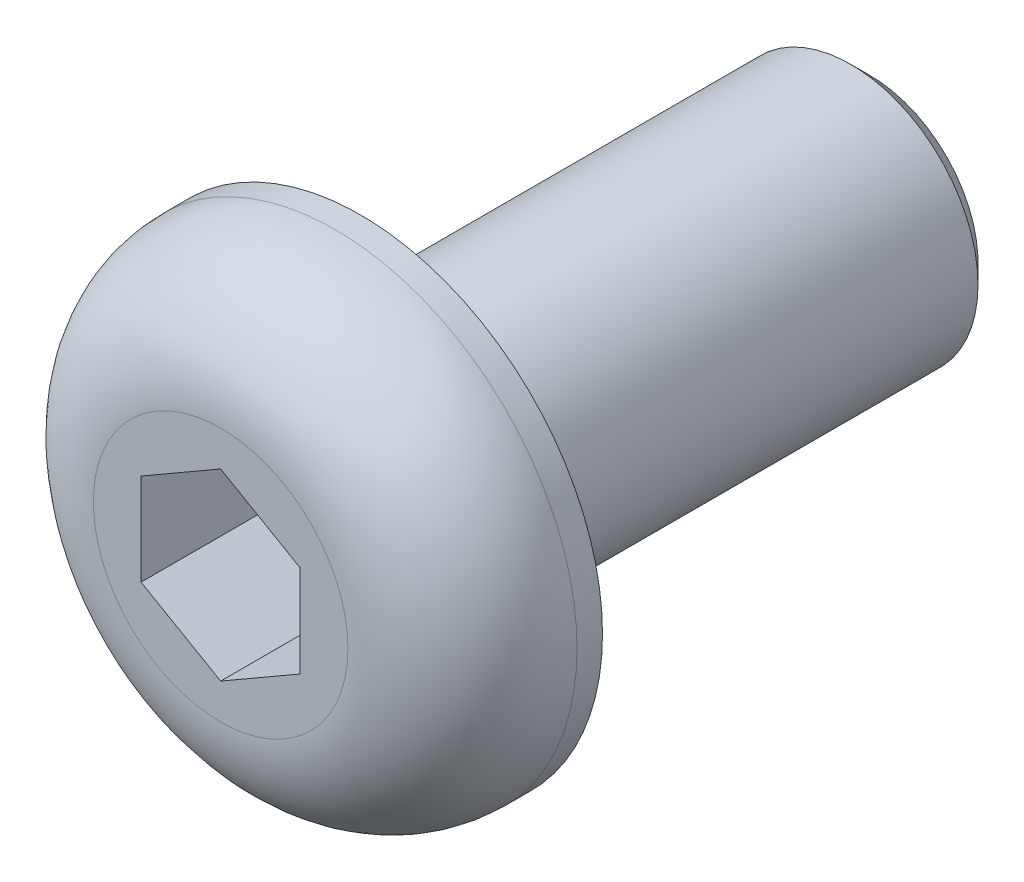
ISO-10303-21;
HEADER;
FILE_DESCRIPTION(('STEP AP214'),'2;1');
FILE_NAME('part.step','',(''),(''),'','','');
FILE_SCHEMA(('AUTOMOTIVE_DESIGN { 1 0 10303 214 1 1 1 1 }'));
ENDSEC;
DATA;
#1=APPLICATION_CONTEXT('core data for automotive mechanical design processes');
#2=APPLICATION_PROTOCOL_DEFINITION('international standard','automotive_design',2000,#1);
#3=PRODUCT_CONTEXT('',#1,'mechanical');
#4=PRODUCT('Part','Part','',(#3));
#5=PRODUCT_RELATED_PRODUCT_CATEGORY('part','',(#4));
#6=PRODUCT_DEFINITION_FORMATION('','',#4);
#7=PRODUCT_DEFINITION_CONTEXT('part definition',#1,'design');
#8=PRODUCT_DEFINITION('design','',#6,#7);
#9=PRODUCT_DEFINITION_SHAPE('','',#8);
#10=(LENGTH_UNIT() NAMED_UNIT(*) SI_UNIT(.MILLI.,.METRE.));
#11=(NAMED_UNIT(*) PLANE_ANGLE_UNIT() SI_UNIT($,.RADIAN.));
#12=(NAMED_UNIT(*) SI_UNIT($,.STERADIAN.) SOLID_ANGLE_UNIT());
#13=UNCERTAINTY_MEASURE_WITH_UNIT(LENGTH_MEASURE(1.E-05),#10,'distance_accuracy_value','');
#14=(GEOMETRIC_REPRESENTATION_CONTEXT(3) GLOBAL_UNCERTAINTY_ASSIGNED_CONTEXT((#13)) GLOBAL_UNIT_ASSIGNED_CONTEXT((#10,
#11,#12)) REPRESENTATION_CONTEXT('',''));
#15=CARTESIAN_POINT('',(0.,0.,0.));
#16=DIRECTION('',(0.,0.,1.));
#17=DIRECTION('',(1.,0.,0.));
#18=AXIS2_PLACEMENT_3D('',#15,#16,#17);
#19=CARTESIAN_POINT('',(0.,0.,0.));
#20=DIRECTION('',(0.,0.,1.));
#21=DIRECTION('',(1.,0.,0.));
#22=AXIS2_PLACEMENT_3D('',#19,#20,#21);
#23=PLANE('',#22);
#24=CARTESIAN_POINT('',(0.,0.,0.));
#25=DIRECTION('',(0.,0.,1.));
#26=DIRECTION('',(1.,0.,0.));
#27=AXIS2_PLACEMENT_3D('',#24,#25,#26);
#28=CIRCLE('',#27,3.8);
#29=CARTESIAN_POINT('',(3.8,0.,0.));
#30=VERTEX_POINT('',#29);
#31=EDGE_CURVE('E135',#30,#30,#28,.T.);
#32=ORIENTED_EDGE('',*,*,#31,.F.);
#33=EDGE_LOOP('',(#32));
#34=FACE_BOUND('',#33,.T.);
#35=CARTESIAN_POINT('',(0.,0.,0.));
#36=DIRECTION('',(0.,0.,1.));
#37=DIRECTION('',(1.,0.,0.));
#38=AXIS2_PLACEMENT_3D('',#35,#36,#37);
#39=CIRCLE('',#38,2.);
#40=CARTESIAN_POINT('',(2.,0.,0.));
#41=VERTEX_POINT('',#40);
#42=EDGE_CURVE('E143',#41,#41,#39,.F.);
#43=ORIENTED_EDGE('',*,*,#42,.F.);
#44=EDGE_LOOP('',(#43));
#45=FACE_BOUND('',#44,.T.);
#46=ADVANCED_FACE('F33',(#34,#45),#23,.F.);
#47=CARTESIAN_POINT('',(0.,0.,2.2));
#48=DIRECTION('',(0.,0.,-1.));
#49=DIRECTION('',(-1.,0.,0.));
#50=AXIS2_PLACEMENT_3D('',#47,#48,#49);
#51=CYLINDRICAL_SURFACE('',#50,3.8);
#52=CARTESIAN_POINT('',(0.,0.,0.4));
#53=DIRECTION('',(0.,0.,1.));
#54=DIRECTION('',(1.,0.,0.));
#55=AXIS2_PLACEMENT_3D('',#52,#53,#54);
#56=CIRCLE('',#55,3.8);
#57=CARTESIAN_POINT('',(3.8,0.,0.4));
#58=VERTEX_POINT('',#57);
#59=EDGE_CURVE('E11',#58,#58,#56,.F.);
#60=ORIENTED_EDGE('',*,*,#59,.T.);
#61=EDGE_LOOP('',(#60));
#62=FACE_BOUND('',#61,.T.);
#63=ORIENTED_EDGE('',*,*,#31,.T.);
#64=EDGE_LOOP('',(#63));
#65=FACE_BOUND('',#64,.T.);
#66=ADVANCED_FACE('F166',(#62,#65),#51,.T.);
#67=CARTESIAN_POINT('',(0.,0.,2.2));
#68=DIRECTION('',(0.,0.,1.));
#69=DIRECTION('',(1.,0.,0.));
#70=AXIS2_PLACEMENT_3D('',#67,#68,#69);
#71=PLANE('',#70);
#72=CARTESIAN_POINT('',(0.,0.,2.2));
#73=DIRECTION('',(0.,0.,1.));
#74=DIRECTION('',(1.,0.,0.));
#75=AXIS2_PLACEMENT_3D('',#72,#73,#74);
#76=CIRCLE('',#75,2.);
#77=CARTESIAN_POINT('',(2.,0.,2.2));
#78=VERTEX_POINT('',#77);
#79=EDGE_CURVE('E41',#78,#78,#76,.T.);
#80=ORIENTED_EDGE('',*,*,#79,.T.);
#81=EDGE_LOOP('',(#80));
#82=FACE_BOUND('',#81,.T.);
#83=DIRECTION('',(-0.866025403784439,0.5,0.));
#84=VECTOR('',#83,1.);
#85=CARTESIAN_POINT('',(1.25,0.721687836487033,2.2));
#86=LINE('',#85,#84);
#87=CARTESIAN_POINT('',(1.25,0.721687836487033,2.2));
#88=VERTEX_POINT('',#87);
#89=CARTESIAN_POINT('',(0.,1.44337567297406,2.2));
#90=VERTEX_POINT('',#89);
#91=EDGE_CURVE('E48',#88,#90,#86,.T.);
#92=ORIENTED_EDGE('',*,*,#91,.F.);
#93=DIRECTION('',(0.,1.,0.));
#94=VECTOR('',#93,1.);
#95=CARTESIAN_POINT('',(1.25,-0.721687836487033,2.2));
#96=LINE('',#95,#94);
#97=CARTESIAN_POINT('',(1.25,-0.721687836487033,2.2));
#98=VERTEX_POINT('',#97);
#99=EDGE_CURVE('E131',#98,#88,#96,.T.);
#100=ORIENTED_EDGE('',*,*,#99,.F.);
#101=DIRECTION('',(0.866025403784439,0.5,0.));
#102=VECTOR('',#101,1.);
#103=CARTESIAN_POINT('',(0.,-1.44337567297406,2.2));
#104=LINE('',#103,#102);
#105=CARTESIAN_POINT('',(0.,-1.44337567297406,2.2));
#106=VERTEX_POINT('',#105);
#107=EDGE_CURVE('E129',#106,#98,#104,.T.);
#108=ORIENTED_EDGE('',*,*,#107,.F.);
#109=DIRECTION('',(0.866025403784439,-0.5,0.));
#110=VECTOR('',#109,1.);
#111=CARTESIAN_POINT('',(-1.25,-0.721687836487032,2.2));
#112=LINE('',#111,#110);
#113=CARTESIAN_POINT('',(-1.25,-0.721687836487032,2.2));
#114=VERTEX_POINT('',#113);
#115=EDGE_CURVE('E96',#114,#106,#112,.T.);
#116=ORIENTED_EDGE('',*,*,#115,.F.);
#117=DIRECTION('',(0.,-1.,0.));
#118=VECTOR('',#117,1.);
#119=CARTESIAN_POINT('',(-1.25,0.721687836487033,2.2));
#120=LINE('',#119,#118);
#121=CARTESIAN_POINT('',(-1.25,0.721687836487033,2.2));
#122=VERTEX_POINT('',#121);
#123=EDGE_CURVE('E125',#122,#114,#120,.T.);
#124=ORIENTED_EDGE('',*,*,#123,.F.);
#125=DIRECTION('',(-0.866025403784439,-0.5,0.));
#126=VECTOR('',#125,1.);
#127=CARTESIAN_POINT('',(0.,1.44337567297406,2.2));
#128=LINE('',#127,#126);
#129=EDGE_CURVE('E122',#90,#122,#128,.T.);
#130=ORIENTED_EDGE('',*,*,#129,.F.);
#131=EDGE_LOOP('',(#92,#100,#108,#116,#124,#130));
#132=FACE_BOUND('',#131,.T.);
#133=ADVANCED_FACE('F154',(#82,#132),#71,.T.);
#134=CARTESIAN_POINT('',(0.,0.,-8.));
#135=DIRECTION('',(0.,0.,1.));
#136=DIRECTION('',(1.,0.,0.));
#137=AXIS2_PLACEMENT_3D('',#134,#135,#136);
#138=CYLINDRICAL_SURFACE('',#137,2.);
#139=CARTESIAN_POINT('',(0.,0.,-7.7));
#140=DIRECTION('',(0.,0.,-1.));
#141=DIRECTION('',(-1.,0.,0.));
#142=AXIS2_PLACEMENT_3D('',#139,#140,#141);
#143=CIRCLE('',#142,2.);
#144=CARTESIAN_POINT('',(-2.,0.,-7.7));
#145=VERTEX_POINT('',#144);
#146=EDGE_CURVE('E149',#145,#145,#143,.F.);
#147=ORIENTED_EDGE('',*,*,#146,.T.);
#148=EDGE_LOOP('',(#147));
#149=FACE_BOUND('',#148,.T.);
#150=ORIENTED_EDGE('',*,*,#42,.T.);
#151=EDGE_LOOP('',(#150));
#152=FACE_BOUND('',#151,.T.);
#153=ADVANCED_FACE('F189',(#149,#152),#138,.T.);
#154=CARTESIAN_POINT('',(0.,0.,-8.));
#155=DIRECTION('',(0.,0.,-1.));
#156=DIRECTION('',(-1.,0.,0.));
#157=AXIS2_PLACEMENT_3D('',#154,#155,#156);
#158=PLANE('',#157);
#159=CARTESIAN_POINT('',(0.,0.,-8.));
#160=DIRECTION('',(0.,0.,-1.));
#161=DIRECTION('',(-1.,0.,0.));
#162=AXIS2_PLACEMENT_3D('',#159,#160,#161);
#163=CIRCLE('',#162,1.7);
#164=CARTESIAN_POINT('',(-1.7,0.,-8.));
#165=VERTEX_POINT('',#164);
#166=EDGE_CURVE('E146',#165,#165,#163,.T.);
#167=ORIENTED_EDGE('',*,*,#166,.T.);
#168=EDGE_LOOP('',(#167));
#169=FACE_BOUND('',#168,.T.);
#170=ADVANCED_FACE('F181',(#169),#158,.T.);
#171=CARTESIAN_POINT('',(0.,0.,-8.));
#172=DIRECTION('',(0.,0.,1.));
#173=DIRECTION('',(1.,0.,0.));
#174=AXIS2_PLACEMENT_3D('',#171,#172,#173);
#175=CONICAL_SURFACE('',#174,1.7,0.785398163397447);
#176=ORIENTED_EDGE('',*,*,#146,.F.);
#177=EDGE_LOOP('',(#176));
#178=FACE_BOUND('',#177,.T.);
#179=ORIENTED_EDGE('',*,*,#166,.F.);
#180=EDGE_LOOP('',(#179));
#181=FACE_BOUND('',#180,.T.);
#182=ADVANCED_FACE('F178',(#178,#181),#175,.T.);
#183=CARTESIAN_POINT('',(1.25,0.721687836487033,0.2));
#184=DIRECTION('',(0.5,0.866025403784439,0.));
#185=DIRECTION('',(-0.866025403784439,0.5,0.));
#186=AXIS2_PLACEMENT_3D('',#183,#184,#185);
#187=PLANE('',#186);
#188=ORIENTED_EDGE('',*,*,#91,.T.);
#189=DIRECTION('',(0.,0.,1.));
#190=VECTOR('',#189,1.);
#191=CARTESIAN_POINT('',(0.,1.44337567297406,0.2));
#192=LINE('',#191,#190);
#193=CARTESIAN_POINT('',(0.,1.44337567297406,0.2));
#194=VERTEX_POINT('',#193);
#195=EDGE_CURVE('E78',#194,#90,#192,.T.);
#196=ORIENTED_EDGE('',*,*,#195,.F.);
#197=DIRECTION('',(-0.866025403784439,0.5,0.));
#198=VECTOR('',#197,1.);
#199=CARTESIAN_POINT('',(1.25,0.721687836487033,0.2));
#200=LINE('',#199,#198);
#201=CARTESIAN_POINT('',(1.25,0.721687836487033,0.2));
#202=VERTEX_POINT('',#201);
#203=EDGE_CURVE('E133',#202,#194,#200,.T.);
#204=ORIENTED_EDGE('',*,*,#203,.F.);
#205=DIRECTION('',(0.,0.,1.));
#206=VECTOR('',#205,1.);
#207=CARTESIAN_POINT('',(1.25,0.721687836487033,0.2));
#208=LINE('',#207,#206);
#209=EDGE_CURVE('E56',#202,#88,#208,.T.);
#210=ORIENTED_EDGE('',*,*,#209,.T.);
#211=EDGE_LOOP('',(#188,#196,#204,#210));
#212=FACE_BOUND('',#211,.T.);
#213=ADVANCED_FACE('F180',(#212),#187,.F.);
#214=CARTESIAN_POINT('',(1.25,-0.721687836487033,0.2));
#215=DIRECTION('',(1.,0.,0.));
#216=DIRECTION('',(0.,1.,0.));
#217=AXIS2_PLACEMENT_3D('',#214,#215,#216);
#218=PLANE('',#217);
#219=ORIENTED_EDGE('',*,*,#99,.T.);
#220=ORIENTED_EDGE('',*,*,#209,.F.);
#221=DIRECTION('',(0.,1.,0.));
#222=VECTOR('',#221,1.);
#223=CARTESIAN_POINT('',(1.25,-0.721687836487033,0.2));
#224=LINE('',#223,#222);
#225=CARTESIAN_POINT('',(1.25,-0.721687836487033,0.2));
#226=VERTEX_POINT('',#225);
#227=EDGE_CURVE('E108',#226,#202,#224,.T.);
#228=ORIENTED_EDGE('',*,*,#227,.F.);
#229=DIRECTION('',(0.,0.,1.));
#230=VECTOR('',#229,1.);
#231=CARTESIAN_POINT('',(1.25,-0.721687836487033,0.2));
#232=LINE('',#231,#230);
#233=EDGE_CURVE('E100',#226,#98,#232,.T.);
#234=ORIENTED_EDGE('',*,*,#233,.T.);
#235=EDGE_LOOP('',(#219,#220,#228,#234));
#236=FACE_BOUND('',#235,.T.);
#237=ADVANCED_FACE('F187',(#236),#218,.F.);
#238=CARTESIAN_POINT('',(0.,-1.44337567297406,0.2));
#239=DIRECTION('',(0.5,-0.866025403784439,0.));
#240=DIRECTION('',(0.866025403784439,0.5,0.));
#241=AXIS2_PLACEMENT_3D('',#238,#239,#240);
#242=PLANE('',#241);
#243=ORIENTED_EDGE('',*,*,#107,.T.);
#244=ORIENTED_EDGE('',*,*,#233,.F.);
#245=DIRECTION('',(0.866025403784439,0.5,0.));
#246=VECTOR('',#245,1.);
#247=CARTESIAN_POINT('',(0.,-1.44337567297406,0.2));
#248=LINE('',#247,#246);
#249=CARTESIAN_POINT('',(0.,-1.44337567297406,0.2));
#250=VERTEX_POINT('',#249);
#251=EDGE_CURVE('E104',#250,#226,#248,.T.);
#252=ORIENTED_EDGE('',*,*,#251,.F.);
#253=DIRECTION('',(0.,0.,1.));
#254=VECTOR('',#253,1.);
#255=CARTESIAN_POINT('',(0.,-1.44337567297406,0.2));
#256=LINE('',#255,#254);
#257=EDGE_CURVE('E89',#250,#106,#256,.T.);
#258=ORIENTED_EDGE('',*,*,#257,.T.);
#259=EDGE_LOOP('',(#243,#244,#252,#258));
#260=FACE_BOUND('',#259,.T.);
#261=ADVANCED_FACE('F105',(#260),#242,.F.);
#262=CARTESIAN_POINT('',(-1.25,-0.721687836487032,0.2));
#263=DIRECTION('',(-0.5,-0.866025403784439,0.));
#264=DIRECTION('',(0.866025403784439,-0.5,0.));
#265=AXIS2_PLACEMENT_3D('',#262,#263,#264);
#266=PLANE('',#265);
#267=ORIENTED_EDGE('',*,*,#115,.T.);
#268=ORIENTED_EDGE('',*,*,#257,.F.);
#269=DIRECTION('',(0.866025403784439,-0.5,0.));
#270=VECTOR('',#269,1.);
#271=CARTESIAN_POINT('',(-1.25,-0.721687836487032,0.2));
#272=LINE('',#271,#270);
#273=CARTESIAN_POINT('',(-1.25,-0.721687836487032,0.2));
#274=VERTEX_POINT('',#273);
#275=EDGE_CURVE('E93',#274,#250,#272,.T.);
#276=ORIENTED_EDGE('',*,*,#275,.F.);
#277=DIRECTION('',(0.,0.,1.));
#278=VECTOR('',#277,1.);
#279=CARTESIAN_POINT('',(-1.25,-0.721687836487032,0.2));
#280=LINE('',#279,#278);
#281=EDGE_CURVE('E101',#274,#114,#280,.T.);
#282=ORIENTED_EDGE('',*,*,#281,.T.);
#283=EDGE_LOOP('',(#267,#268,#276,#282));
#284=FACE_BOUND('',#283,.T.);
#285=ADVANCED_FACE('F91',(#284),#266,.F.);
#286=CARTESIAN_POINT('',(-1.25,0.721687836487033,0.2));
#287=DIRECTION('',(-1.,0.,0.));
#288=DIRECTION('',(0.,0.,1.));
#289=AXIS2_PLACEMENT_3D('',#286,#287,#288);
#290=PLANE('',#289);
#291=ORIENTED_EDGE('',*,*,#123,.T.);
#292=ORIENTED_EDGE('',*,*,#281,.F.);
#293=DIRECTION('',(0.,-1.,0.));
#294=VECTOR('',#293,1.);
#295=CARTESIAN_POINT('',(-1.25,0.721687836487033,0.2));
#296=LINE('',#295,#294);
#297=CARTESIAN_POINT('',(-1.25,0.721687836487033,0.2));
#298=VERTEX_POINT('',#297);
#299=EDGE_CURVE('E114',#298,#274,#296,.T.);
#300=ORIENTED_EDGE('',*,*,#299,.F.);
#301=DIRECTION('',(0.,0.,1.));
#302=VECTOR('',#301,1.);
#303=CARTESIAN_POINT('',(-1.25,0.721687836487033,0.2));
#304=LINE('',#303,#302);
#305=EDGE_CURVE('E138',#298,#122,#304,.T.);
#306=ORIENTED_EDGE('',*,*,#305,.T.);
#307=EDGE_LOOP('',(#291,#292,#300,#306));
#308=FACE_BOUND('',#307,.T.);
#309=ADVANCED_FACE('F205',(#308),#290,.F.);
#310=CARTESIAN_POINT('',(0.,1.44337567297406,0.2));
#311=DIRECTION('',(-0.5,0.866025403784439,0.));
#312=DIRECTION('',(-0.866025403784439,-0.5,0.));
#313=AXIS2_PLACEMENT_3D('',#310,#311,#312);
#314=PLANE('',#313);
#315=ORIENTED_EDGE('',*,*,#129,.T.);
#316=ORIENTED_EDGE('',*,*,#305,.F.);
#317=DIRECTION('',(-0.866025403784439,-0.5,0.));
#318=VECTOR('',#317,1.);
#319=CARTESIAN_POINT('',(0.,1.44337567297406,0.2));
#320=LINE('',#319,#318);
#321=EDGE_CURVE('E116',#194,#298,#320,.T.);
#322=ORIENTED_EDGE('',*,*,#321,.F.);
#323=ORIENTED_EDGE('',*,*,#195,.T.);
#324=EDGE_LOOP('',(#315,#316,#322,#323));
#325=FACE_BOUND('',#324,.T.);
#326=ADVANCED_FACE('F162',(#325),#314,.F.);
#327=CARTESIAN_POINT('',(0.,0.,0.2));
#328=DIRECTION('',(0.,0.,1.));
#329=DIRECTION('',(1.,0.,0.));
#330=AXIS2_PLACEMENT_3D('',#327,#328,#329);
#331=PLANE('',#330);
#332=ORIENTED_EDGE('',*,*,#203,.T.);
#333=ORIENTED_EDGE('',*,*,#321,.T.);
#334=ORIENTED_EDGE('',*,*,#299,.T.);
#335=ORIENTED_EDGE('',*,*,#275,.T.);
#336=ORIENTED_EDGE('',*,*,#251,.T.);
#337=ORIENTED_EDGE('',*,*,#227,.T.);
#338=EDGE_LOOP('',(#332,#333,#334,#335,#336,#337));
#339=FACE_BOUND('',#338,.T.);
#340=ADVANCED_FACE('F111',(#339),#331,.T.);
#341=CARTESIAN_POINT('',(0.,0.,0.4));
#342=DIRECTION('',(0.,0.,1.));
#343=DIRECTION('',(1.,0.,0.));
#344=AXIS2_PLACEMENT_3D('',#341,#342,#343);
#345=TOROIDAL_SURFACE('',#344,2.,1.8);
#346=ORIENTED_EDGE('',*,*,#59,.F.);
#347=EDGE_LOOP('',(#346));
#348=FACE_BOUND('',#347,.T.);
#349=ORIENTED_EDGE('',*,*,#79,.F.);
#350=EDGE_LOOP('',(#349));
#351=FACE_BOUND('',#350,.T.);
#352=ADVANCED_FACE('F35',(#348,#351),#345,.T.);
#353=CLOSED_SHELL('',(#46,#66,#133,#153,#170,#182,#213,#237,#261,#285,#309,#326,#340,#352));
#354=MANIFOLD_SOLID_BREP('B2',#353);
#355=ADVANCED_BREP_SHAPE_REPRESENTATION('',(#18,#354),#14);
#356=SHAPE_DEFINITION_REPRESENTATION(#9,#355);
ENDSEC;
END-ISO-10303-21;
